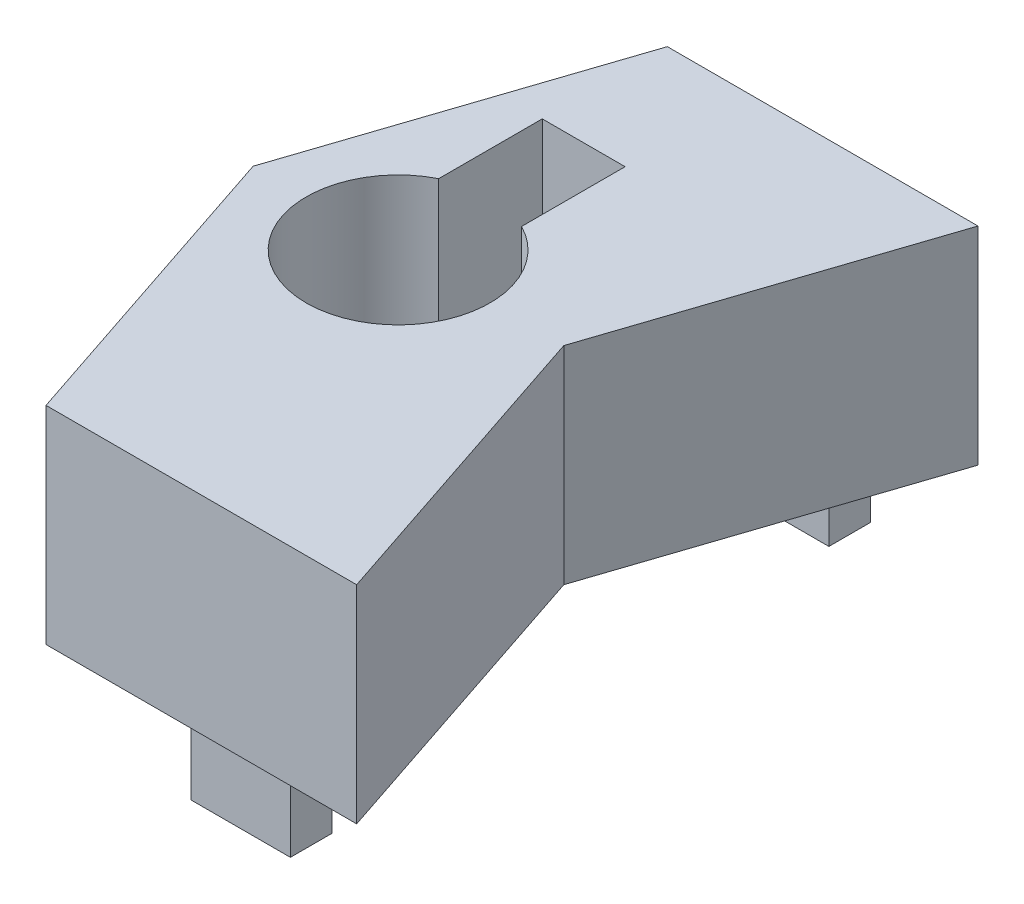
ISO-10303-21;
HEADER;
FILE_DESCRIPTION(('STEP AP214'),'2;1');
FILE_NAME('part.step','',(''),(''),'','','');
FILE_SCHEMA(('AUTOMOTIVE_DESIGN { 1 0 10303 214 1 1 1 1 }'));
ENDSEC;
DATA;
#1=APPLICATION_CONTEXT('core data for automotive mechanical design processes');
#2=APPLICATION_PROTOCOL_DEFINITION('international standard','automotive_design',2000,#1);
#3=PRODUCT_CONTEXT('',#1,'mechanical');
#4=PRODUCT('Part','Part','',(#3));
#5=PRODUCT_RELATED_PRODUCT_CATEGORY('part','',(#4));
#6=PRODUCT_DEFINITION_FORMATION('','',#4);
#7=PRODUCT_DEFINITION_CONTEXT('part definition',#1,'design');
#8=PRODUCT_DEFINITION('design','',#6,#7);
#9=PRODUCT_DEFINITION_SHAPE('','',#8);
#10=(LENGTH_UNIT() NAMED_UNIT(*) SI_UNIT(.MILLI.,.METRE.));
#11=(NAMED_UNIT(*) PLANE_ANGLE_UNIT() SI_UNIT($,.RADIAN.));
#12=(NAMED_UNIT(*) SI_UNIT($,.STERADIAN.) SOLID_ANGLE_UNIT());
#13=UNCERTAINTY_MEASURE_WITH_UNIT(LENGTH_MEASURE(1.E-05),#10,'distance_accuracy_value','');
#14=(GEOMETRIC_REPRESENTATION_CONTEXT(3) GLOBAL_UNCERTAINTY_ASSIGNED_CONTEXT((#13)) GLOBAL_UNIT_ASSIGNED_CONTEXT((#10,
#11,#12)) REPRESENTATION_CONTEXT('',''));
#15=CARTESIAN_POINT('',(0.,0.,0.));
#16=DIRECTION('',(0.,0.,1.));
#17=DIRECTION('',(1.,0.,0.));
#18=AXIS2_PLACEMENT_3D('',#15,#16,#17);
#19=CARTESIAN_POINT('',(0.,0.,0.));
#20=DIRECTION('',(0.,1.,0.));
#21=DIRECTION('',(0.,0.,1.));
#22=AXIS2_PLACEMENT_3D('',#19,#20,#21);
#23=PLANE('',#22);
#24=DIRECTION('',(1.,0.,0.));
#25=VECTOR('',#24,1.);
#26=CARTESIAN_POINT('',(13.716,0.,-1.27000000000001));
#27=LINE('',#26,#25);
#28=CARTESIAN_POINT('',(7.62,0.,-1.27));
#29=VERTEX_POINT('',#28);
#30=CARTESIAN_POINT('',(13.716,0.,-1.27000000000001));
#31=VERTEX_POINT('',#30);
#32=EDGE_CURVE('E215',#29,#31,#27,.T.);
#33=ORIENTED_EDGE('',*,*,#32,.T.);
#34=DIRECTION('',(0.,0.,-1.));
#35=VECTOR('',#34,1.);
#36=CARTESIAN_POINT('',(13.716,0.,-1.27000000000001));
#37=LINE('',#36,#35);
#38=CARTESIAN_POINT('',(13.716,0.,-3.81000000000001));
#39=VERTEX_POINT('',#38);
#40=EDGE_CURVE('E183',#31,#39,#37,.T.);
#41=ORIENTED_EDGE('',*,*,#40,.T.);
#42=DIRECTION('',(-1.,0.,0.));
#43=VECTOR('',#42,1.);
#44=CARTESIAN_POINT('',(13.716,0.,-3.81000000000001));
#45=LINE('',#44,#43);
#46=CARTESIAN_POINT('',(7.62,0.,-3.81000000000001));
#47=VERTEX_POINT('',#46);
#48=EDGE_CURVE('E201',#39,#47,#45,.T.);
#49=ORIENTED_EDGE('',*,*,#48,.T.);
#50=DIRECTION('',(0.,0.,1.));
#51=VECTOR('',#50,1.);
#52=CARTESIAN_POINT('',(7.62,0.,-1.27));
#53=LINE('',#52,#51);
#54=EDGE_CURVE('E61',#47,#29,#53,.T.);
#55=ORIENTED_EDGE('',*,*,#54,.T.);
#56=EDGE_LOOP('',(#33,#41,#49,#55));
#57=FACE_BOUND('',#56,.T.);
#58=DIRECTION('',(0.316227766016838,0.,0.948683298050514));
#59=VECTOR('',#58,1.);
#60=CARTESIAN_POINT('',(-6.35,0.,-19.05));
#61=LINE('',#60,#59);
#62=CARTESIAN_POINT('',(-6.35,0.,-19.05));
#63=VERTEX_POINT('',#62);
#64=CARTESIAN_POINT('',(0.,0.,0.));
#65=VERTEX_POINT('',#64);
#66=EDGE_CURVE('E318',#63,#65,#61,.T.);
#67=ORIENTED_EDGE('',*,*,#66,.F.);
#68=DIRECTION('',(-0.316227766016838,0.,0.948683298050514));
#69=VECTOR('',#68,1.);
#70=CARTESIAN_POINT('',(0.,0.,-38.1));
#71=LINE('',#70,#69);
#72=CARTESIAN_POINT('',(0.,0.,-38.1));
#73=VERTEX_POINT('',#72);
#74=EDGE_CURVE('E327',#73,#63,#71,.T.);
#75=ORIENTED_EDGE('',*,*,#74,.F.);
#76=DIRECTION('',(-1.,0.,0.));
#77=VECTOR('',#76,1.);
#78=CARTESIAN_POINT('',(19.05,0.,-38.1));
#79=LINE('',#78,#77);
#80=CARTESIAN_POINT('',(19.05,0.,-38.1));
#81=VERTEX_POINT('',#80);
#82=EDGE_CURVE('E355',#81,#73,#79,.T.);
#83=ORIENTED_EDGE('',*,*,#82,.F.);
#84=DIRECTION('',(0.316227766016838,0.,-0.948683298050514));
#85=VECTOR('',#84,1.);
#86=CARTESIAN_POINT('',(12.7,0.,-19.05));
#87=LINE('',#86,#85);
#88=CARTESIAN_POINT('',(12.7,0.,-19.05));
#89=VERTEX_POINT('',#88);
#90=EDGE_CURVE('E352',#89,#81,#87,.T.);
#91=ORIENTED_EDGE('',*,*,#90,.F.);
#92=DIRECTION('',(-0.316227766016838,0.,-0.948683298050514));
#93=VECTOR('',#92,1.);
#94=CARTESIAN_POINT('',(19.05,0.,0.));
#95=LINE('',#94,#93);
#96=CARTESIAN_POINT('',(19.05,0.,0.));
#97=VERTEX_POINT('',#96);
#98=EDGE_CURVE('E349',#97,#89,#95,.T.);
#99=ORIENTED_EDGE('',*,*,#98,.F.);
#100=DIRECTION('',(1.,0.,0.));
#101=VECTOR('',#100,1.);
#102=CARTESIAN_POINT('',(0.,0.,0.));
#103=LINE('',#102,#101);
#104=EDGE_CURVE('E346',#65,#97,#103,.T.);
#105=ORIENTED_EDGE('',*,*,#104,.F.);
#106=EDGE_LOOP('',(#67,#75,#83,#91,#99,#105));
#107=FACE_BOUND('',#106,.T.);
#108=DIRECTION('',(-1.,0.,0.));
#109=VECTOR('',#108,1.);
#110=CARTESIAN_POINT('',(5.08,0.,-24.0800721040468));
#111=LINE('',#110,#109);
#112=CARTESIAN_POINT('',(5.08,0.,-24.0800721040468));
#113=VERTEX_POINT('',#112);
#114=CARTESIAN_POINT('',(0.,0.,-24.0800721040468));
#115=VERTEX_POINT('',#114);
#116=EDGE_CURVE('E288',#113,#115,#111,.T.);
#117=ORIENTED_EDGE('',*,*,#116,.F.);
#118=DIRECTION('',(0.,0.,1.));
#119=VECTOR('',#118,1.);
#120=CARTESIAN_POINT('',(5.08,0.,-24.0800721040468));
#121=LINE('',#120,#119);
#122=CARTESIAN_POINT('',(5.08,0.,-30.4300721040468));
#123=VERTEX_POINT('',#122);
#124=EDGE_CURVE('E271',#123,#113,#121,.T.);
#125=ORIENTED_EDGE('',*,*,#124,.F.);
#126=DIRECTION('',(1.,0.,0.));
#127=VECTOR('',#126,1.);
#128=CARTESIAN_POINT('',(5.08,0.,-30.4300721040468));
#129=LINE('',#128,#127);
#130=CARTESIAN_POINT('',(0.,0.,-30.4300721040468));
#131=VERTEX_POINT('',#130);
#132=EDGE_CURVE('E277',#131,#123,#129,.T.);
#133=ORIENTED_EDGE('',*,*,#132,.F.);
#134=DIRECTION('',(0.,0.,-1.));
#135=VECTOR('',#134,1.);
#136=CARTESIAN_POINT('',(0.,0.,-24.0800721040468));
#137=LINE('',#136,#135);
#138=EDGE_CURVE('E292',#115,#131,#137,.T.);
#139=ORIENTED_EDGE('',*,*,#138,.F.);
#140=EDGE_LOOP('',(#117,#125,#133,#139));
#141=FACE_BOUND('',#140,.T.);
#142=DIRECTION('',(0.,0.,1.));
#143=VECTOR('',#142,1.);
#144=CARTESIAN_POINT('',(13.716,0.,-36.83));
#145=LINE('',#144,#143);
#146=CARTESIAN_POINT('',(13.716,0.,-36.83));
#147=VERTEX_POINT('',#146);
#148=CARTESIAN_POINT('',(13.716,0.,-34.29));
#149=VERTEX_POINT('',#148);
#150=EDGE_CURVE('E189',#147,#149,#145,.T.);
#151=ORIENTED_EDGE('',*,*,#150,.F.);
#152=DIRECTION('',(1.,0.,0.));
#153=VECTOR('',#152,1.);
#154=CARTESIAN_POINT('',(13.716,0.,-36.83));
#155=LINE('',#154,#153);
#156=CARTESIAN_POINT('',(7.62,0.,-36.83));
#157=VERTEX_POINT('',#156);
#158=EDGE_CURVE('E235',#157,#147,#155,.T.);
#159=ORIENTED_EDGE('',*,*,#158,.F.);
#160=DIRECTION('',(0.,0.,-1.));
#161=VECTOR('',#160,1.);
#162=CARTESIAN_POINT('',(7.62,0.,-36.83));
#163=LINE('',#162,#161);
#164=CARTESIAN_POINT('',(7.62,0.,-34.29));
#165=VERTEX_POINT('',#164);
#166=EDGE_CURVE('E250',#165,#157,#163,.T.);
#167=ORIENTED_EDGE('',*,*,#166,.F.);
#168=DIRECTION('',(-1.,0.,0.));
#169=VECTOR('',#168,1.);
#170=CARTESIAN_POINT('',(13.716,0.,-34.29));
#171=LINE('',#170,#169);
#172=EDGE_CURVE('E69',#149,#165,#171,.T.);
#173=ORIENTED_EDGE('',*,*,#172,.F.);
#174=EDGE_LOOP('',(#151,#159,#167,#173));
#175=FACE_BOUND('',#174,.T.);
#176=ADVANCED_FACE('F45',(#57,#107,#141,#175),#23,.F.);
#177=CARTESIAN_POINT('',(-6.35,12.7,-19.05));
#178=DIRECTION('',(0.948683298050514,0.,-0.316227766016838));
#179=DIRECTION('',(-0.316227766016838,0.,-0.948683298050514));
#180=AXIS2_PLACEMENT_3D('',#177,#178,#179);
#181=PLANE('',#180);
#182=ORIENTED_EDGE('',*,*,#66,.T.);
#183=DIRECTION('',(0.,-1.,0.));
#184=VECTOR('',#183,1.);
#185=CARTESIAN_POINT('',(0.,12.7,0.));
#186=LINE('',#185,#184);
#187=CARTESIAN_POINT('',(0.,12.7,0.));
#188=VERTEX_POINT('',#187);
#189=EDGE_CURVE('E54',#188,#65,#186,.T.);
#190=ORIENTED_EDGE('',*,*,#189,.F.);
#191=DIRECTION('',(0.316227766016838,0.,0.948683298050514));
#192=VECTOR('',#191,1.);
#193=CARTESIAN_POINT('',(-6.35,12.7,-19.05));
#194=LINE('',#193,#192);
#195=CARTESIAN_POINT('',(-6.35,12.7,-19.05));
#196=VERTEX_POINT('',#195);
#197=EDGE_CURVE('E322',#196,#188,#194,.T.);
#198=ORIENTED_EDGE('',*,*,#197,.F.);
#199=DIRECTION('',(0.,-1.,0.));
#200=VECTOR('',#199,1.);
#201=CARTESIAN_POINT('',(-6.35,12.7,-19.05));
#202=LINE('',#201,#200);
#203=EDGE_CURVE('E342',#196,#63,#202,.T.);
#204=ORIENTED_EDGE('',*,*,#203,.T.);
#205=EDGE_LOOP('',(#182,#190,#198,#204));
#206=FACE_BOUND('',#205,.T.);
#207=ADVANCED_FACE('F47',(#206),#181,.F.);
#208=CARTESIAN_POINT('',(0.,12.7,0.));
#209=DIRECTION('',(0.,0.,-1.));
#210=DIRECTION('',(-1.,0.,0.));
#211=AXIS2_PLACEMENT_3D('',#208,#209,#210);
#212=PLANE('',#211);
#213=ORIENTED_EDGE('',*,*,#104,.T.);
#214=DIRECTION('',(0.,-1.,0.));
#215=VECTOR('',#214,1.);
#216=CARTESIAN_POINT('',(19.05,12.7,0.));
#217=LINE('',#216,#215);
#218=CARTESIAN_POINT('',(19.05,12.7,0.));
#219=VERTEX_POINT('',#218);
#220=EDGE_CURVE('E375',#219,#97,#217,.T.);
#221=ORIENTED_EDGE('',*,*,#220,.F.);
#222=DIRECTION('',(1.,0.,0.));
#223=VECTOR('',#222,1.);
#224=CARTESIAN_POINT('',(0.,12.7,0.));
#225=LINE('',#224,#223);
#226=EDGE_CURVE('E326',#188,#219,#225,.T.);
#227=ORIENTED_EDGE('',*,*,#226,.F.);
#228=ORIENTED_EDGE('',*,*,#189,.T.);
#229=EDGE_LOOP('',(#213,#221,#227,#228));
#230=FACE_BOUND('',#229,.T.);
#231=ADVANCED_FACE('F382',(#230),#212,.F.);
#232=CARTESIAN_POINT('',(19.05,12.7,0.));
#233=DIRECTION('',(-0.948683298050514,0.,0.316227766016838));
#234=DIRECTION('',(0.316227766016838,0.,0.948683298050514));
#235=AXIS2_PLACEMENT_3D('',#232,#233,#234);
#236=PLANE('',#235);
#237=ORIENTED_EDGE('',*,*,#98,.T.);
#238=DIRECTION('',(0.,-1.,0.));
#239=VECTOR('',#238,1.);
#240=CARTESIAN_POINT('',(12.7,12.7,-19.05));
#241=LINE('',#240,#239);
#242=CARTESIAN_POINT('',(12.7,12.7,-19.05));
#243=VERTEX_POINT('',#242);
#244=EDGE_CURVE('E371',#243,#89,#241,.T.);
#245=ORIENTED_EDGE('',*,*,#244,.F.);
#246=DIRECTION('',(-0.316227766016838,0.,-0.948683298050514));
#247=VECTOR('',#246,1.);
#248=CARTESIAN_POINT('',(19.05,12.7,0.));
#249=LINE('',#248,#247);
#250=EDGE_CURVE('E330',#219,#243,#249,.T.);
#251=ORIENTED_EDGE('',*,*,#250,.F.);
#252=ORIENTED_EDGE('',*,*,#220,.T.);
#253=EDGE_LOOP('',(#237,#245,#251,#252));
#254=FACE_BOUND('',#253,.T.);
#255=ADVANCED_FACE('F396',(#254),#236,.F.);
#256=CARTESIAN_POINT('',(12.7,12.7,-19.05));
#257=DIRECTION('',(-0.948683298050514,0.,-0.316227766016838));
#258=DIRECTION('',(-0.316227766016838,0.,0.948683298050514));
#259=AXIS2_PLACEMENT_3D('',#256,#257,#258);
#260=PLANE('',#259);
#261=ORIENTED_EDGE('',*,*,#90,.T.);
#262=DIRECTION('',(0.,-1.,0.));
#263=VECTOR('',#262,1.);
#264=CARTESIAN_POINT('',(19.05,12.7,-38.1));
#265=LINE('',#264,#263);
#266=CARTESIAN_POINT('',(19.05,12.7,-38.1));
#267=VERTEX_POINT('',#266);
#268=EDGE_CURVE('E367',#267,#81,#265,.T.);
#269=ORIENTED_EDGE('',*,*,#268,.F.);
#270=DIRECTION('',(0.316227766016838,0.,-0.948683298050514));
#271=VECTOR('',#270,1.);
#272=CARTESIAN_POINT('',(12.7,12.7,-19.05));
#273=LINE('',#272,#271);
#274=EDGE_CURVE('E333',#243,#267,#273,.T.);
#275=ORIENTED_EDGE('',*,*,#274,.F.);
#276=ORIENTED_EDGE('',*,*,#244,.T.);
#277=EDGE_LOOP('',(#261,#269,#275,#276));
#278=FACE_BOUND('',#277,.T.);
#279=ADVANCED_FACE('F400',(#278),#260,.F.);
#280=CARTESIAN_POINT('',(19.05,12.7,-38.1));
#281=DIRECTION('',(0.,0.,1.));
#282=DIRECTION('',(1.,0.,0.));
#283=AXIS2_PLACEMENT_3D('',#280,#281,#282);
#284=PLANE('',#283);
#285=ORIENTED_EDGE('',*,*,#82,.T.);
#286=DIRECTION('',(0.,-1.,0.));
#287=VECTOR('',#286,1.);
#288=CARTESIAN_POINT('',(0.,12.7,-38.1));
#289=LINE('',#288,#287);
#290=CARTESIAN_POINT('',(0.,12.7,-38.1));
#291=VERTEX_POINT('',#290);
#292=EDGE_CURVE('E363',#291,#73,#289,.T.);
#293=ORIENTED_EDGE('',*,*,#292,.F.);
#294=DIRECTION('',(-1.,0.,0.));
#295=VECTOR('',#294,1.);
#296=CARTESIAN_POINT('',(19.05,12.7,-38.1));
#297=LINE('',#296,#295);
#298=EDGE_CURVE('E336',#267,#291,#297,.T.);
#299=ORIENTED_EDGE('',*,*,#298,.F.);
#300=ORIENTED_EDGE('',*,*,#268,.T.);
#301=EDGE_LOOP('',(#285,#293,#299,#300));
#302=FACE_BOUND('',#301,.T.);
#303=ADVANCED_FACE('F410',(#302),#284,.F.);
#304=CARTESIAN_POINT('',(0.,12.7,-38.1));
#305=DIRECTION('',(0.948683298050514,0.,0.316227766016838));
#306=DIRECTION('',(0.316227766016838,0.,-0.948683298050514));
#307=AXIS2_PLACEMENT_3D('',#304,#305,#306);
#308=PLANE('',#307);
#309=ORIENTED_EDGE('',*,*,#74,.T.);
#310=ORIENTED_EDGE('',*,*,#203,.F.);
#311=DIRECTION('',(-0.316227766016838,0.,0.948683298050514));
#312=VECTOR('',#311,1.);
#313=CARTESIAN_POINT('',(0.,12.7,-38.1));
#314=LINE('',#313,#312);
#315=EDGE_CURVE('E339',#291,#196,#314,.T.);
#316=ORIENTED_EDGE('',*,*,#315,.F.);
#317=ORIENTED_EDGE('',*,*,#292,.T.);
#318=EDGE_LOOP('',(#309,#310,#316,#317));
#319=FACE_BOUND('',#318,.T.);
#320=ADVANCED_FACE('F408',(#319),#308,.F.);
#321=CARTESIAN_POINT('',(0.,12.7,0.));
#322=DIRECTION('',(0.,1.,0.));
#323=DIRECTION('',(0.,0.,1.));
#324=AXIS2_PLACEMENT_3D('',#321,#322,#323);
#325=PLANE('',#324);
#326=DIRECTION('',(0.,0.,1.));
#327=VECTOR('',#326,1.);
#328=CARTESIAN_POINT('',(5.08,12.7,-24.0800721040468));
#329=LINE('',#328,#327);
#330=CARTESIAN_POINT('',(5.08,12.7,-30.4300721040468));
#331=VERTEX_POINT('',#330);
#332=CARTESIAN_POINT('',(5.08,12.7,-24.0800721040468));
#333=VERTEX_POINT('',#332);
#334=EDGE_CURVE('E272',#331,#333,#329,.T.);
#335=ORIENTED_EDGE('',*,*,#334,.T.);
#336=CARTESIAN_POINT('',(2.54,12.7,-19.05));
#337=DIRECTION('',(0.,-1.,0.));
#338=DIRECTION('',(0.,0.,-1.));
#339=AXIS2_PLACEMENT_3D('',#336,#337,#338);
#340=CIRCLE('',#339,5.635000033);
#341=CARTESIAN_POINT('',(0.,12.7,-24.0800721040468));
#342=VERTEX_POINT('',#341);
#343=EDGE_CURVE('E302',#333,#342,#340,.T.);
#344=ORIENTED_EDGE('',*,*,#343,.T.);
#345=DIRECTION('',(0.,0.,-1.));
#346=VECTOR('',#345,1.);
#347=CARTESIAN_POINT('',(0.,12.7,-24.0800721040468));
#348=LINE('',#347,#346);
#349=CARTESIAN_POINT('',(0.,12.7,-30.4300721040468));
#350=VERTEX_POINT('',#349);
#351=EDGE_CURVE('E276',#342,#350,#348,.T.);
#352=ORIENTED_EDGE('',*,*,#351,.T.);
#353=DIRECTION('',(1.,0.,0.));
#354=VECTOR('',#353,1.);
#355=CARTESIAN_POINT('',(5.08,12.7,-30.4300721040468));
#356=LINE('',#355,#354);
#357=EDGE_CURVE('E281',#350,#331,#356,.T.);
#358=ORIENTED_EDGE('',*,*,#357,.T.);
#359=EDGE_LOOP('',(#335,#344,#352,#358));
#360=FACE_BOUND('',#359,.T.);
#361=ORIENTED_EDGE('',*,*,#197,.T.);
#362=ORIENTED_EDGE('',*,*,#226,.T.);
#363=ORIENTED_EDGE('',*,*,#250,.T.);
#364=ORIENTED_EDGE('',*,*,#274,.T.);
#365=ORIENTED_EDGE('',*,*,#298,.T.);
#366=ORIENTED_EDGE('',*,*,#315,.T.);
#367=EDGE_LOOP('',(#361,#362,#363,#364,#365,#366));
#368=FACE_BOUND('',#367,.T.);
#369=ADVANCED_FACE('F404',(#360,#368),#325,.T.);
#370=CARTESIAN_POINT('',(2.54,3.142000066,-19.05));
#371=DIRECTION('',(0.,1.,0.));
#372=DIRECTION('',(0.,0.,1.));
#373=AXIS2_PLACEMENT_3D('',#370,#371,#372);
#374=CYLINDRICAL_SURFACE('',#373,5.635000033);
#375=DIRECTION('',(0.,-1.,0.));
#376=VECTOR('',#375,1.);
#377=CARTESIAN_POINT('',(5.08,12.7,-24.0800721040468));
#378=LINE('',#377,#376);
#379=CARTESIAN_POINT('',(5.08,3.142000066,-24.0800721040468));
#380=VERTEX_POINT('',#379);
#381=EDGE_CURVE('E310',#333,#380,#378,.T.);
#382=ORIENTED_EDGE('',*,*,#381,.T.);
#383=CARTESIAN_POINT('',(2.54,3.142000066,-19.05));
#384=DIRECTION('',(0.,-1.,0.));
#385=DIRECTION('',(0.,0.,-1.));
#386=AXIS2_PLACEMENT_3D('',#383,#384,#385);
#387=CIRCLE('',#386,5.635000033);
#388=CARTESIAN_POINT('',(0.,3.142000066,-24.0800721040468));
#389=VERTEX_POINT('',#388);
#390=EDGE_CURVE('E314',#380,#389,#387,.T.);
#391=ORIENTED_EDGE('',*,*,#390,.T.);
#392=DIRECTION('',(0.,-1.,0.));
#393=VECTOR('',#392,1.);
#394=CARTESIAN_POINT('',(0.,12.7,-24.0800721040468));
#395=LINE('',#394,#393);
#396=EDGE_CURVE('E306',#342,#389,#395,.T.);
#397=ORIENTED_EDGE('',*,*,#396,.F.);
#398=ORIENTED_EDGE('',*,*,#343,.F.);
#399=EDGE_LOOP('',(#382,#391,#397,#398));
#400=FACE_BOUND('',#399,.T.);
#401=ADVANCED_FACE('F428',(#400),#374,.F.);
#402=CARTESIAN_POINT('',(2.54,3.142000066,-19.05));
#403=DIRECTION('',(0.,-1.,0.));
#404=DIRECTION('',(0.,0.,-1.));
#405=AXIS2_PLACEMENT_3D('',#402,#403,#404);
#406=PLANE('',#405);
#407=ORIENTED_EDGE('',*,*,#390,.F.);
#408=DIRECTION('',(-1.,0.,0.));
#409=VECTOR('',#408,1.);
#410=CARTESIAN_POINT('',(2.54,3.142000066,-24.0800721040468));
#411=LINE('',#410,#409);
#412=EDGE_CURVE('E12',#380,#389,#411,.T.);
#413=ORIENTED_EDGE('',*,*,#412,.T.);
#414=EDGE_LOOP('',(#407,#413));
#415=FACE_BOUND('',#414,.T.);
#416=ADVANCED_FACE('F432',(#415),#406,.F.);
#417=CARTESIAN_POINT('',(5.08,12.7,-24.0800721040468));
#418=DIRECTION('',(0.,0.,1.));
#419=DIRECTION('',(1.,0.,0.));
#420=AXIS2_PLACEMENT_3D('',#417,#418,#419);
#421=PLANE('',#420);
#422=EDGE_CURVE('E285',#380,#113,#378,.T.);
#423=ORIENTED_EDGE('',*,*,#422,.T.);
#424=ORIENTED_EDGE('',*,*,#116,.T.);
#425=EDGE_CURVE('E309',#389,#115,#395,.T.);
#426=ORIENTED_EDGE('',*,*,#425,.F.);
#427=ORIENTED_EDGE('',*,*,#412,.F.);
#428=EDGE_LOOP('',(#423,#424,#426,#427));
#429=FACE_BOUND('',#428,.T.);
#430=ADVANCED_FACE('F436',(#429),#421,.F.);
#431=CARTESIAN_POINT('',(5.08,12.7,-24.0800721040468));
#432=DIRECTION('',(1.,0.,0.));
#433=DIRECTION('',(0.,0.,-1.));
#434=AXIS2_PLACEMENT_3D('',#431,#432,#433);
#435=PLANE('',#434);
#436=ORIENTED_EDGE('',*,*,#124,.T.);
#437=ORIENTED_EDGE('',*,*,#422,.F.);
#438=ORIENTED_EDGE('',*,*,#381,.F.);
#439=ORIENTED_EDGE('',*,*,#334,.F.);
#440=DIRECTION('',(0.,-1.,0.));
#441=VECTOR('',#440,1.);
#442=CARTESIAN_POINT('',(5.08,12.7,-30.4300721040468));
#443=LINE('',#442,#441);
#444=EDGE_CURVE('E299',#331,#123,#443,.T.);
#445=ORIENTED_EDGE('',*,*,#444,.T.);
#446=EDGE_LOOP('',(#436,#437,#438,#439,#445));
#447=FACE_BOUND('',#446,.T.);
#448=ADVANCED_FACE('F438',(#447),#435,.F.);
#449=CARTESIAN_POINT('',(5.08,12.7,-30.4300721040468));
#450=DIRECTION('',(0.,0.,-1.));
#451=DIRECTION('',(-1.,0.,0.));
#452=AXIS2_PLACEMENT_3D('',#449,#450,#451);
#453=PLANE('',#452);
#454=ORIENTED_EDGE('',*,*,#132,.T.);
#455=ORIENTED_EDGE('',*,*,#444,.F.);
#456=ORIENTED_EDGE('',*,*,#357,.F.);
#457=DIRECTION('',(0.,-1.,0.));
#458=VECTOR('',#457,1.);
#459=CARTESIAN_POINT('',(0.,12.7,-30.4300721040468));
#460=LINE('',#459,#458);
#461=EDGE_CURVE('E303',#350,#131,#460,.T.);
#462=ORIENTED_EDGE('',*,*,#461,.T.);
#463=EDGE_LOOP('',(#454,#455,#456,#462));
#464=FACE_BOUND('',#463,.T.);
#465=ADVANCED_FACE('F441',(#464),#453,.F.);
#466=CARTESIAN_POINT('',(0.,12.7,-24.0800721040468));
#467=DIRECTION('',(-1.,0.,0.));
#468=DIRECTION('',(0.,0.,1.));
#469=AXIS2_PLACEMENT_3D('',#466,#467,#468);
#470=PLANE('',#469);
#471=ORIENTED_EDGE('',*,*,#138,.T.);
#472=ORIENTED_EDGE('',*,*,#461,.F.);
#473=ORIENTED_EDGE('',*,*,#351,.F.);
#474=ORIENTED_EDGE('',*,*,#396,.T.);
#475=ORIENTED_EDGE('',*,*,#425,.T.);
#476=EDGE_LOOP('',(#471,#472,#473,#474,#475));
#477=FACE_BOUND('',#476,.T.);
#478=ADVANCED_FACE('F446',(#477),#470,.F.);
#479=CARTESIAN_POINT('',(13.716,-5.08,-36.83));
#480=DIRECTION('',(-1.,0.,0.));
#481=DIRECTION('',(0.,0.,1.));
#482=AXIS2_PLACEMENT_3D('',#479,#480,#481);
#483=PLANE('',#482);
#484=ORIENTED_EDGE('',*,*,#150,.T.);
#485=DIRECTION('',(0.,1.,0.));
#486=VECTOR('',#485,1.);
#487=CARTESIAN_POINT('',(13.716,-5.08,-34.29));
#488=LINE('',#487,#486);
#489=CARTESIAN_POINT('',(13.716,-5.08,-34.29));
#490=VERTEX_POINT('',#489);
#491=EDGE_CURVE('E268',#490,#149,#488,.T.);
#492=ORIENTED_EDGE('',*,*,#491,.F.);
#493=DIRECTION('',(0.,0.,1.));
#494=VECTOR('',#493,1.);
#495=CARTESIAN_POINT('',(13.716,-5.08,-36.83));
#496=LINE('',#495,#494);
#497=CARTESIAN_POINT('',(13.716,-5.08,-36.83));
#498=VERTEX_POINT('',#497);
#499=EDGE_CURVE('E230',#498,#490,#496,.T.);
#500=ORIENTED_EDGE('',*,*,#499,.F.);
#501=DIRECTION('',(0.,1.,0.));
#502=VECTOR('',#501,1.);
#503=CARTESIAN_POINT('',(13.716,-5.08,-36.83));
#504=LINE('',#503,#502);
#505=EDGE_CURVE('E244',#498,#147,#504,.T.);
#506=ORIENTED_EDGE('',*,*,#505,.T.);
#507=EDGE_LOOP('',(#484,#492,#500,#506));
#508=FACE_BOUND('',#507,.T.);
#509=ADVANCED_FACE('F449',(#508),#483,.F.);
#510=CARTESIAN_POINT('',(13.716,-5.08,-34.29));
#511=DIRECTION('',(0.,0.,-1.));
#512=DIRECTION('',(-1.,0.,0.));
#513=AXIS2_PLACEMENT_3D('',#510,#511,#512);
#514=PLANE('',#513);
#515=ORIENTED_EDGE('',*,*,#172,.T.);
#516=DIRECTION('',(0.,1.,0.));
#517=VECTOR('',#516,1.);
#518=CARTESIAN_POINT('',(7.62,-5.08,-34.29));
#519=LINE('',#518,#517);
#520=CARTESIAN_POINT('',(7.62,-5.08,-34.29));
#521=VERTEX_POINT('',#520);
#522=EDGE_CURVE('E264',#521,#165,#519,.T.);
#523=ORIENTED_EDGE('',*,*,#522,.F.);
#524=DIRECTION('',(-1.,0.,0.));
#525=VECTOR('',#524,1.);
#526=CARTESIAN_POINT('',(13.716,-5.08,-34.29));
#527=LINE('',#526,#525);
#528=EDGE_CURVE('E234',#490,#521,#527,.T.);
#529=ORIENTED_EDGE('',*,*,#528,.F.);
#530=ORIENTED_EDGE('',*,*,#491,.T.);
#531=EDGE_LOOP('',(#515,#523,#529,#530));
#532=FACE_BOUND('',#531,.T.);
#533=ADVANCED_FACE('F456',(#532),#514,.F.);
#534=CARTESIAN_POINT('',(7.62,-5.08,-36.83));
#535=DIRECTION('',(1.,0.,0.));
#536=DIRECTION('',(0.,0.,-1.));
#537=AXIS2_PLACEMENT_3D('',#534,#535,#536);
#538=PLANE('',#537);
#539=ORIENTED_EDGE('',*,*,#166,.T.);
#540=DIRECTION('',(0.,1.,0.));
#541=VECTOR('',#540,1.);
#542=CARTESIAN_POINT('',(7.62,-5.08,-36.83));
#543=LINE('',#542,#541);
#544=CARTESIAN_POINT('',(7.62,-5.08,-36.83));
#545=VERTEX_POINT('',#544);
#546=EDGE_CURVE('E260',#545,#157,#543,.T.);
#547=ORIENTED_EDGE('',*,*,#546,.F.);
#548=DIRECTION('',(0.,0.,-1.));
#549=VECTOR('',#548,1.);
#550=CARTESIAN_POINT('',(7.62,-5.08,-36.83));
#551=LINE('',#550,#549);
#552=EDGE_CURVE('E238',#521,#545,#551,.T.);
#553=ORIENTED_EDGE('',*,*,#552,.F.);
#554=ORIENTED_EDGE('',*,*,#522,.T.);
#555=EDGE_LOOP('',(#539,#547,#553,#554));
#556=FACE_BOUND('',#555,.T.);
#557=ADVANCED_FACE('F460',(#556),#538,.F.);
#558=CARTESIAN_POINT('',(13.716,-5.08,-36.83));
#559=DIRECTION('',(0.,0.,1.));
#560=DIRECTION('',(1.,0.,0.));
#561=AXIS2_PLACEMENT_3D('',#558,#559,#560);
#562=PLANE('',#561);
#563=ORIENTED_EDGE('',*,*,#158,.T.);
#564=ORIENTED_EDGE('',*,*,#505,.F.);
#565=DIRECTION('',(1.,0.,0.));
#566=VECTOR('',#565,1.);
#567=CARTESIAN_POINT('',(13.716,-5.08,-36.83));
#568=LINE('',#567,#566);
#569=EDGE_CURVE('E241',#545,#498,#568,.T.);
#570=ORIENTED_EDGE('',*,*,#569,.F.);
#571=ORIENTED_EDGE('',*,*,#546,.T.);
#572=EDGE_LOOP('',(#563,#564,#570,#571));
#573=FACE_BOUND('',#572,.T.);
#574=ADVANCED_FACE('F464',(#573),#562,.F.);
#575=CARTESIAN_POINT('',(0.,-5.08,0.));
#576=DIRECTION('',(0.,-1.,0.));
#577=DIRECTION('',(0.,0.,-1.));
#578=AXIS2_PLACEMENT_3D('',#575,#576,#577);
#579=PLANE('',#578);
#580=ORIENTED_EDGE('',*,*,#499,.T.);
#581=ORIENTED_EDGE('',*,*,#528,.T.);
#582=ORIENTED_EDGE('',*,*,#552,.T.);
#583=ORIENTED_EDGE('',*,*,#569,.T.);
#584=EDGE_LOOP('',(#580,#581,#582,#583));
#585=FACE_BOUND('',#584,.T.);
#586=ADVANCED_FACE('F468',(#585),#579,.T.);
#587=CARTESIAN_POINT('',(13.716,-5.08,-1.27000000000001));
#588=DIRECTION('',(1.,0.,0.));
#589=DIRECTION('',(0.,0.,-1.));
#590=AXIS2_PLACEMENT_3D('',#587,#588,#589);
#591=PLANE('',#590);
#592=ORIENTED_EDGE('',*,*,#40,.F.);
#593=DIRECTION('',(0.,1.,0.));
#594=VECTOR('',#593,1.);
#595=CARTESIAN_POINT('',(13.716,-5.08,-1.27000000000001));
#596=LINE('',#595,#594);
#597=CARTESIAN_POINT('',(13.716,-5.08,-1.27000000000001));
#598=VERTEX_POINT('',#597);
#599=EDGE_CURVE('E177',#598,#31,#596,.T.);
#600=ORIENTED_EDGE('',*,*,#599,.F.);
#601=DIRECTION('',(0.,0.,-1.));
#602=VECTOR('',#601,1.);
#603=CARTESIAN_POINT('',(13.716,-5.08,-1.27000000000001));
#604=LINE('',#603,#602);
#605=CARTESIAN_POINT('',(13.716,-5.08,-3.81000000000001));
#606=VERTEX_POINT('',#605);
#607=EDGE_CURVE('E180',#598,#606,#604,.T.);
#608=ORIENTED_EDGE('',*,*,#607,.T.);
#609=DIRECTION('',(0.,1.,0.));
#610=VECTOR('',#609,1.);
#611=CARTESIAN_POINT('',(13.716,-5.08,-3.81000000000001));
#612=LINE('',#611,#610);
#613=EDGE_CURVE('E212',#606,#39,#612,.T.);
#614=ORIENTED_EDGE('',*,*,#613,.T.);
#615=EDGE_LOOP('',(#592,#600,#608,#614));
#616=FACE_BOUND('',#615,.T.);
#617=ADVANCED_FACE('F179',(#616),#591,.T.);
#618=CARTESIAN_POINT('',(13.716,-5.08,-1.27000000000001));
#619=DIRECTION('',(0.,0.,1.));
#620=DIRECTION('',(1.,0.,0.));
#621=AXIS2_PLACEMENT_3D('',#618,#619,#620);
#622=PLANE('',#621);
#623=ORIENTED_EDGE('',*,*,#32,.F.);
#624=DIRECTION('',(0.,1.,0.));
#625=VECTOR('',#624,1.);
#626=CARTESIAN_POINT('',(7.62,-5.08,-1.27));
#627=LINE('',#626,#625);
#628=CARTESIAN_POINT('',(7.62,-5.08,-1.27));
#629=VERTEX_POINT('',#628);
#630=EDGE_CURVE('E190',#629,#29,#627,.T.);
#631=ORIENTED_EDGE('',*,*,#630,.F.);
#632=DIRECTION('',(1.,0.,0.));
#633=VECTOR('',#632,1.);
#634=CARTESIAN_POINT('',(13.716,-5.08,-1.27000000000001));
#635=LINE('',#634,#633);
#636=EDGE_CURVE('E196',#629,#598,#635,.T.);
#637=ORIENTED_EDGE('',*,*,#636,.T.);
#638=ORIENTED_EDGE('',*,*,#599,.T.);
#639=EDGE_LOOP('',(#623,#631,#637,#638));
#640=FACE_BOUND('',#639,.T.);
#641=ADVANCED_FACE('F203',(#640),#622,.T.);
#642=CARTESIAN_POINT('',(7.62,-5.08,-1.27));
#643=DIRECTION('',(-1.,0.,0.));
#644=DIRECTION('',(0.,0.,1.));
#645=AXIS2_PLACEMENT_3D('',#642,#643,#644);
#646=PLANE('',#645);
#647=ORIENTED_EDGE('',*,*,#54,.F.);
#648=DIRECTION('',(0.,1.,0.));
#649=VECTOR('',#648,1.);
#650=CARTESIAN_POINT('',(7.62,-5.08,-3.81));
#651=LINE('',#650,#649);
#652=CARTESIAN_POINT('',(7.62,-5.08,-3.81));
#653=VERTEX_POINT('',#652);
#654=EDGE_CURVE('E225',#653,#47,#651,.T.);
#655=ORIENTED_EDGE('',*,*,#654,.F.);
#656=DIRECTION('',(0.,0.,1.));
#657=VECTOR('',#656,1.);
#658=CARTESIAN_POINT('',(7.62,-5.08,-1.27));
#659=LINE('',#658,#657);
#660=EDGE_CURVE('E205',#653,#629,#659,.T.);
#661=ORIENTED_EDGE('',*,*,#660,.T.);
#662=ORIENTED_EDGE('',*,*,#630,.T.);
#663=EDGE_LOOP('',(#647,#655,#661,#662));
#664=FACE_BOUND('',#663,.T.);
#665=ADVANCED_FACE('F477',(#664),#646,.T.);
#666=CARTESIAN_POINT('',(13.716,-5.08,-3.81000000000001));
#667=DIRECTION('',(0.,0.,-1.));
#668=DIRECTION('',(-1.,0.,0.));
#669=AXIS2_PLACEMENT_3D('',#666,#667,#668);
#670=PLANE('',#669);
#671=ORIENTED_EDGE('',*,*,#48,.F.);
#672=ORIENTED_EDGE('',*,*,#613,.F.);
#673=DIRECTION('',(-1.,0.,0.));
#674=VECTOR('',#673,1.);
#675=CARTESIAN_POINT('',(13.716,-5.08,-3.81000000000001));
#676=LINE('',#675,#674);
#677=EDGE_CURVE('E199',#606,#653,#676,.T.);
#678=ORIENTED_EDGE('',*,*,#677,.T.);
#679=ORIENTED_EDGE('',*,*,#654,.T.);
#680=EDGE_LOOP('',(#671,#672,#678,#679));
#681=FACE_BOUND('',#680,.T.);
#682=ADVANCED_FACE('F480',(#681),#670,.T.);
#683=CARTESIAN_POINT('',(0.,-5.08,-38.1));
#684=DIRECTION('',(0.,-1.,0.));
#685=DIRECTION('',(0.,0.,1.));
#686=AXIS2_PLACEMENT_3D('',#683,#684,#685);
#687=PLANE('',#686);
#688=ORIENTED_EDGE('',*,*,#607,.F.);
#689=ORIENTED_EDGE('',*,*,#636,.F.);
#690=ORIENTED_EDGE('',*,*,#660,.F.);
#691=ORIENTED_EDGE('',*,*,#677,.F.);
#692=EDGE_LOOP('',(#688,#689,#690,#691));
#693=FACE_BOUND('',#692,.T.);
#694=ADVANCED_FACE('F194',(#693),#687,.T.);
#695=CLOSED_SHELL('',(#176,#207,#231,#255,#279,#303,#320,#369,#401,#416,#430,#448,#465,#478,
#509,#533,#557,#574,#586,#617,#641,#665,#682,#694));
#696=MANIFOLD_SOLID_BREP('B2',#695);
#697=ADVANCED_BREP_SHAPE_REPRESENTATION('',(#18,#696),#14);
#698=SHAPE_DEFINITION_REPRESENTATION(#9,#697);
ENDSEC;
END-ISO-10303-21;
